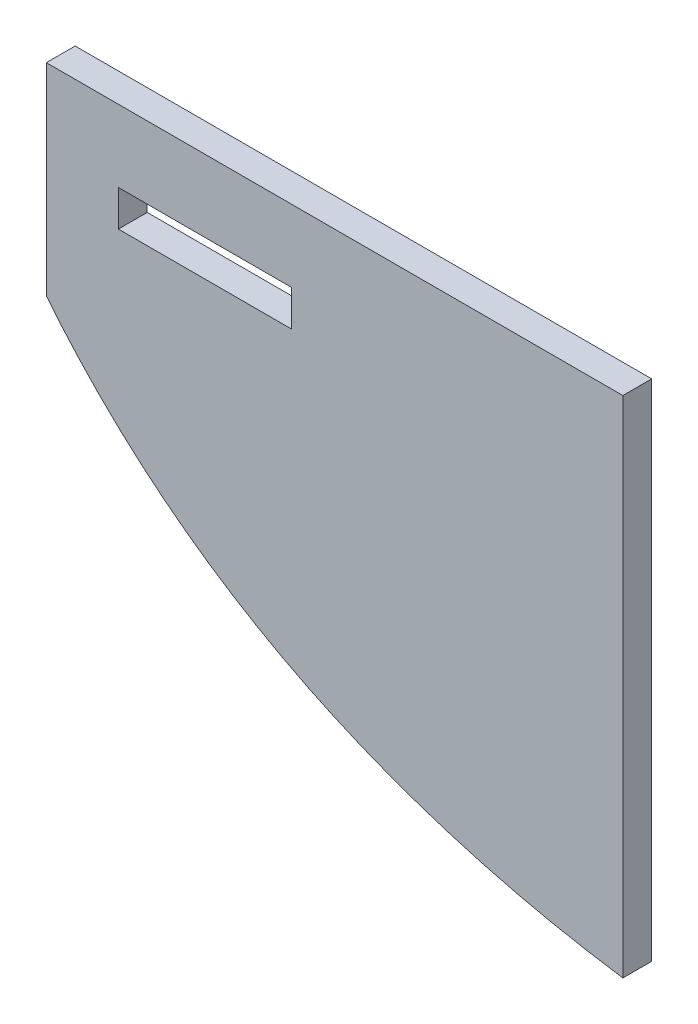
ISO-10303-21;
HEADER;
FILE_DESCRIPTION(('STEP AP214'),'2;1');
FILE_NAME('part.step','',(''),(''),'','','');
FILE_SCHEMA(('AUTOMOTIVE_DESIGN { 1 0 10303 214 1 1 1 1 }'));
ENDSEC;
DATA;
#1=APPLICATION_CONTEXT('core data for automotive mechanical design processes');
#2=APPLICATION_PROTOCOL_DEFINITION('international standard','automotive_design',2000,#1);
#3=PRODUCT_CONTEXT('',#1,'mechanical');
#4=PRODUCT('Part','Part','',(#3));
#5=PRODUCT_RELATED_PRODUCT_CATEGORY('part','',(#4));
#6=PRODUCT_DEFINITION_FORMATION('','',#4);
#7=PRODUCT_DEFINITION_CONTEXT('part definition',#1,'design');
#8=PRODUCT_DEFINITION('design','',#6,#7);
#9=PRODUCT_DEFINITION_SHAPE('','',#8);
#10=(LENGTH_UNIT() NAMED_UNIT(*) SI_UNIT(.MILLI.,.METRE.));
#11=(NAMED_UNIT(*) PLANE_ANGLE_UNIT() SI_UNIT($,.RADIAN.));
#12=(NAMED_UNIT(*) SI_UNIT($,.STERADIAN.) SOLID_ANGLE_UNIT());
#13=UNCERTAINTY_MEASURE_WITH_UNIT(LENGTH_MEASURE(1.E-05),#10,'distance_accuracy_value','');
#14=(GEOMETRIC_REPRESENTATION_CONTEXT(3) GLOBAL_UNCERTAINTY_ASSIGNED_CONTEXT((#13)) GLOBAL_UNIT_ASSIGNED_CONTEXT((#10,
#11,#12)) REPRESENTATION_CONTEXT('',''));
#15=CARTESIAN_POINT('',(0.,0.,0.));
#16=DIRECTION('',(0.,0.,1.));
#17=DIRECTION('',(1.,0.,0.));
#18=AXIS2_PLACEMENT_3D('',#15,#16,#17);
#19=CARTESIAN_POINT('',(0.,0.,2.));
#20=DIRECTION('',(0.,0.,-1.));
#21=DIRECTION('',(-1.,0.,0.));
#22=AXIS2_PLACEMENT_3D('',#19,#20,#21);
#23=PLANE('',#22);
#24=DIRECTION('',(0.,-1.,0.));
#25=VECTOR('',#24,1.);
#26=CARTESIAN_POINT('',(-20.,-17.5,2.));
#27=LINE('',#26,#25);
#28=CARTESIAN_POINT('',(-20.,17.5,2.));
#29=VERTEX_POINT('',#28);
#30=CARTESIAN_POINT('',(-20.0000000000738,3.48377974515954,2.));
#31=VERTEX_POINT('',#30);
#32=EDGE_CURVE('E110',#29,#31,#27,.T.);
#33=ORIENTED_EDGE('',*,*,#32,.T.);
#34=CARTESIAN_POINT('',(20.,-17.5,2.));
#35=CARTESIAN_POINT('',(-15.3606608467541,-12.269480231344,2.));
#36=CARTESIAN_POINT('',(-28.0306781575064,16.9364817728308,2.));
#37=B_SPLINE_CURVE_WITH_KNOTS('',2,(#34,#35,#36),.UNSPECIFIED.,.F.,.F.,(3,3),(0.,1.),.UNSPECIFIED.);
#38=CARTESIAN_POINT('',(20.,-17.5,2.));
#39=VERTEX_POINT('',#38);
#40=EDGE_CURVE('E102',#39,#31,#37,.T.);
#41=ORIENTED_EDGE('',*,*,#40,.F.);
#42=DIRECTION('',(0.,1.,0.));
#43=VECTOR('',#42,1.);
#44=CARTESIAN_POINT('',(20.,-17.5,2.));
#45=LINE('',#44,#43);
#46=CARTESIAN_POINT('',(20.,17.5,2.));
#47=VERTEX_POINT('',#46);
#48=EDGE_CURVE('E116',#39,#47,#45,.T.);
#49=ORIENTED_EDGE('',*,*,#48,.T.);
#50=DIRECTION('',(-1.,0.,0.));
#51=VECTOR('',#50,1.);
#52=CARTESIAN_POINT('',(-20.,17.5,2.));
#53=LINE('',#52,#51);
#54=EDGE_CURVE('E121',#47,#29,#53,.T.);
#55=ORIENTED_EDGE('',*,*,#54,.T.);
#56=EDGE_LOOP('',(#33,#41,#49,#55));
#57=FACE_BOUND('',#56,.T.);
#58=DIRECTION('',(0.,-1.,0.));
#59=VECTOR('',#58,1.);
#60=CARTESIAN_POINT('',(-15.,10.,2.));
#61=LINE('',#60,#59);
#62=CARTESIAN_POINT('',(-15.,12.5,2.));
#63=VERTEX_POINT('',#62);
#64=CARTESIAN_POINT('',(-15.,10.,2.));
#65=VERTEX_POINT('',#64);
#66=EDGE_CURVE('E151',#63,#65,#61,.T.);
#67=ORIENTED_EDGE('',*,*,#66,.F.);
#68=DIRECTION('',(-1.,0.,0.));
#69=VECTOR('',#68,1.);
#70=CARTESIAN_POINT('',(-15.,12.5,2.));
#71=LINE('',#70,#69);
#72=CARTESIAN_POINT('',(-3.,12.5,2.));
#73=VERTEX_POINT('',#72);
#74=EDGE_CURVE('E161',#73,#63,#71,.T.);
#75=ORIENTED_EDGE('',*,*,#74,.F.);
#76=DIRECTION('',(0.,1.,0.));
#77=VECTOR('',#76,1.);
#78=CARTESIAN_POINT('',(-3.,10.,2.));
#79=LINE('',#78,#77);
#80=CARTESIAN_POINT('',(-3.,10.,2.));
#81=VERTEX_POINT('',#80);
#82=EDGE_CURVE('E159',#81,#73,#79,.T.);
#83=ORIENTED_EDGE('',*,*,#82,.F.);
#84=DIRECTION('',(1.,0.,0.));
#85=VECTOR('',#84,1.);
#86=CARTESIAN_POINT('',(-15.,10.,2.));
#87=LINE('',#86,#85);
#88=EDGE_CURVE('E156',#65,#81,#87,.T.);
#89=ORIENTED_EDGE('',*,*,#88,.F.);
#90=EDGE_LOOP('',(#67,#75,#83,#89));
#91=FACE_BOUND('',#90,.T.);
#92=ADVANCED_FACE('F33',(#57,#91),#23,.F.);
#93=CARTESIAN_POINT('',(0.,0.,0.));
#94=DIRECTION('',(0.,0.,-1.));
#95=DIRECTION('',(-1.,0.,0.));
#96=AXIS2_PLACEMENT_3D('',#93,#94,#95);
#97=PLANE('',#96);
#98=CARTESIAN_POINT('',(20.,-17.5,0.));
#99=CARTESIAN_POINT('',(-15.3606608467541,-12.269480231344,0.));
#100=CARTESIAN_POINT('',(-28.0306781575064,16.9364817728308,0.));
#101=B_SPLINE_CURVE_WITH_KNOTS('',2,(#98,#99,#100),.UNSPECIFIED.,.F.,.F.,(3,3),(0.,1.),.UNSPECIFIED.);
#102=CARTESIAN_POINT('',(-20.,3.48377974506775,0.));
#103=VERTEX_POINT('',#102);
#104=CARTESIAN_POINT('',(20.,-17.5,0.));
#105=VERTEX_POINT('',#104);
#106=EDGE_CURVE('E105',#103,#105,#101,.F.);
#107=ORIENTED_EDGE('',*,*,#106,.F.);
#108=DIRECTION('',(0.,-1.,0.));
#109=VECTOR('',#108,1.);
#110=CARTESIAN_POINT('',(-20.,-17.5,0.));
#111=LINE('',#110,#109);
#112=CARTESIAN_POINT('',(-20.,17.5,0.));
#113=VERTEX_POINT('',#112);
#114=EDGE_CURVE('E122',#113,#103,#111,.T.);
#115=ORIENTED_EDGE('',*,*,#114,.F.);
#116=DIRECTION('',(-1.,0.,0.));
#117=VECTOR('',#116,1.);
#118=CARTESIAN_POINT('',(-20.,17.5,0.));
#119=LINE('',#118,#117);
#120=CARTESIAN_POINT('',(20.,17.5,0.));
#121=VERTEX_POINT('',#120);
#122=EDGE_CURVE('E126',#121,#113,#119,.T.);
#123=ORIENTED_EDGE('',*,*,#122,.F.);
#124=DIRECTION('',(0.,1.,0.));
#125=VECTOR('',#124,1.);
#126=CARTESIAN_POINT('',(20.,-17.5,0.));
#127=LINE('',#126,#125);
#128=EDGE_CURVE('E133',#105,#121,#127,.T.);
#129=ORIENTED_EDGE('',*,*,#128,.F.);
#130=EDGE_LOOP('',(#107,#115,#123,#129));
#131=FACE_BOUND('',#130,.T.);
#132=DIRECTION('',(-1.,0.,0.));
#133=VECTOR('',#132,1.);
#134=CARTESIAN_POINT('',(-15.,12.5,0.));
#135=LINE('',#134,#133);
#136=CARTESIAN_POINT('',(-3.,12.5,0.));
#137=VERTEX_POINT('',#136);
#138=CARTESIAN_POINT('',(-15.,12.5,0.));
#139=VERTEX_POINT('',#138);
#140=EDGE_CURVE('E157',#137,#139,#135,.T.);
#141=ORIENTED_EDGE('',*,*,#140,.T.);
#142=DIRECTION('',(0.,-1.,0.));
#143=VECTOR('',#142,1.);
#144=CARTESIAN_POINT('',(-15.,10.,0.));
#145=LINE('',#144,#143);
#146=CARTESIAN_POINT('',(-15.,10.,0.));
#147=VERTEX_POINT('',#146);
#148=EDGE_CURVE('E56',#139,#147,#145,.T.);
#149=ORIENTED_EDGE('',*,*,#148,.T.);
#150=DIRECTION('',(1.,0.,0.));
#151=VECTOR('',#150,1.);
#152=CARTESIAN_POINT('',(-15.,10.,0.));
#153=LINE('',#152,#151);
#154=CARTESIAN_POINT('',(-3.,10.,0.));
#155=VERTEX_POINT('',#154);
#156=EDGE_CURVE('E145',#147,#155,#153,.T.);
#157=ORIENTED_EDGE('',*,*,#156,.T.);
#158=DIRECTION('',(0.,1.,0.));
#159=VECTOR('',#158,1.);
#160=CARTESIAN_POINT('',(-3.,10.,0.));
#161=LINE('',#160,#159);
#162=EDGE_CURVE('E166',#155,#137,#161,.T.);
#163=ORIENTED_EDGE('',*,*,#162,.T.);
#164=EDGE_LOOP('',(#141,#149,#157,#163));
#165=FACE_BOUND('',#164,.T.);
#166=ADVANCED_FACE('F142',(#131,#165),#97,.T.);
#167=CARTESIAN_POINT('',(20.,-17.5,2.));
#168=DIRECTION('',(-1.,0.,0.));
#169=DIRECTION('',(0.,0.,1.));
#170=AXIS2_PLACEMENT_3D('',#167,#168,#169);
#171=PLANE('',#170);
#172=ORIENTED_EDGE('',*,*,#128,.T.);
#173=DIRECTION('',(0.,0.,-1.));
#174=VECTOR('',#173,1.);
#175=CARTESIAN_POINT('',(20.,17.5,2.));
#176=LINE('',#175,#174);
#177=EDGE_CURVE('E11',#47,#121,#176,.T.);
#178=ORIENTED_EDGE('',*,*,#177,.F.);
#179=ORIENTED_EDGE('',*,*,#48,.F.);
#180=DIRECTION('',(0.,0.,-1.));
#181=VECTOR('',#180,1.);
#182=CARTESIAN_POINT('',(20.,-17.5,2.));
#183=LINE('',#182,#181);
#184=EDGE_CURVE('E99',#39,#105,#183,.T.);
#185=ORIENTED_EDGE('',*,*,#184,.T.);
#186=EDGE_LOOP('',(#172,#178,#179,#185));
#187=FACE_BOUND('',#186,.T.);
#188=ADVANCED_FACE('F35',(#187),#171,.F.);
#189=CARTESIAN_POINT('',(-20.,17.5,2.));
#190=DIRECTION('',(0.,-1.,0.));
#191=DIRECTION('',(0.,0.,-1.));
#192=AXIS2_PLACEMENT_3D('',#189,#190,#191);
#193=PLANE('',#192);
#194=ORIENTED_EDGE('',*,*,#122,.T.);
#195=DIRECTION('',(0.,0.,-1.));
#196=VECTOR('',#195,1.);
#197=CARTESIAN_POINT('',(-20.,17.5,2.));
#198=LINE('',#197,#196);
#199=EDGE_CURVE('E41',#29,#113,#198,.T.);
#200=ORIENTED_EDGE('',*,*,#199,.F.);
#201=ORIENTED_EDGE('',*,*,#54,.F.);
#202=ORIENTED_EDGE('',*,*,#177,.T.);
#203=EDGE_LOOP('',(#194,#200,#201,#202));
#204=FACE_BOUND('',#203,.T.);
#205=ADVANCED_FACE('F203',(#204),#193,.F.);
#206=CARTESIAN_POINT('',(-20.,-17.5,2.));
#207=DIRECTION('',(1.,0.,0.));
#208=DIRECTION('',(0.,0.,-1.));
#209=AXIS2_PLACEMENT_3D('',#206,#207,#208);
#210=PLANE('',#209);
#211=ORIENTED_EDGE('',*,*,#114,.T.);
#212=DIRECTION('',(0.,0.,1.));
#213=VECTOR('',#212,1.);
#214=CARTESIAN_POINT('',(-20.,3.48377974506775,-8.));
#215=LINE('',#214,#213);
#216=EDGE_CURVE('E119',#103,#31,#215,.T.);
#217=ORIENTED_EDGE('',*,*,#216,.T.);
#218=ORIENTED_EDGE('',*,*,#32,.F.);
#219=ORIENTED_EDGE('',*,*,#199,.T.);
#220=EDGE_LOOP('',(#211,#217,#218,#219));
#221=FACE_BOUND('',#220,.T.);
#222=ADVANCED_FACE('F139',(#221),#210,.F.);
#223=CARTESIAN_POINT('',(-15.,10.,2.));
#224=DIRECTION('',(1.,0.,0.));
#225=DIRECTION('',(0.,0.,-1.));
#226=AXIS2_PLACEMENT_3D('',#223,#224,#225);
#227=PLANE('',#226);
#228=ORIENTED_EDGE('',*,*,#148,.F.);
#229=DIRECTION('',(0.,0.,-1.));
#230=VECTOR('',#229,1.);
#231=CARTESIAN_POINT('',(-15.,12.5,2.));
#232=LINE('',#231,#230);
#233=EDGE_CURVE('E162',#63,#139,#232,.T.);
#234=ORIENTED_EDGE('',*,*,#233,.F.);
#235=ORIENTED_EDGE('',*,*,#66,.T.);
#236=DIRECTION('',(0.,0.,-1.));
#237=VECTOR('',#236,1.);
#238=CARTESIAN_POINT('',(-15.,10.,2.));
#239=LINE('',#238,#237);
#240=EDGE_CURVE('E129',#65,#147,#239,.T.);
#241=ORIENTED_EDGE('',*,*,#240,.T.);
#242=EDGE_LOOP('',(#228,#234,#235,#241));
#243=FACE_BOUND('',#242,.T.);
#244=ADVANCED_FACE('F177',(#243),#227,.T.);
#245=CARTESIAN_POINT('',(-15.,10.,2.));
#246=DIRECTION('',(0.,1.,0.));
#247=DIRECTION('',(0.,0.,1.));
#248=AXIS2_PLACEMENT_3D('',#245,#246,#247);
#249=PLANE('',#248);
#250=ORIENTED_EDGE('',*,*,#156,.F.);
#251=ORIENTED_EDGE('',*,*,#240,.F.);
#252=ORIENTED_EDGE('',*,*,#88,.T.);
#253=DIRECTION('',(0.,0.,-1.));
#254=VECTOR('',#253,1.);
#255=CARTESIAN_POINT('',(-3.,10.,2.));
#256=LINE('',#255,#254);
#257=EDGE_CURVE('E172',#81,#155,#256,.T.);
#258=ORIENTED_EDGE('',*,*,#257,.T.);
#259=EDGE_LOOP('',(#250,#251,#252,#258));
#260=FACE_BOUND('',#259,.T.);
#261=ADVANCED_FACE('F183',(#260),#249,.T.);
#262=CARTESIAN_POINT('',(-3.,10.,2.));
#263=DIRECTION('',(-1.,0.,0.));
#264=DIRECTION('',(0.,0.,1.));
#265=AXIS2_PLACEMENT_3D('',#262,#263,#264);
#266=PLANE('',#265);
#267=ORIENTED_EDGE('',*,*,#162,.F.);
#268=ORIENTED_EDGE('',*,*,#257,.F.);
#269=ORIENTED_EDGE('',*,*,#82,.T.);
#270=DIRECTION('',(0.,0.,-1.));
#271=VECTOR('',#270,1.);
#272=CARTESIAN_POINT('',(-3.,12.5,2.));
#273=LINE('',#272,#271);
#274=EDGE_CURVE('E48',#73,#137,#273,.T.);
#275=ORIENTED_EDGE('',*,*,#274,.T.);
#276=EDGE_LOOP('',(#267,#268,#269,#275));
#277=FACE_BOUND('',#276,.T.);
#278=ADVANCED_FACE('F185',(#277),#266,.T.);
#279=CARTESIAN_POINT('',(-15.,12.5,2.));
#280=DIRECTION('',(0.,-1.,0.));
#281=DIRECTION('',(0.,0.,-1.));
#282=AXIS2_PLACEMENT_3D('',#279,#280,#281);
#283=PLANE('',#282);
#284=ORIENTED_EDGE('',*,*,#140,.F.);
#285=ORIENTED_EDGE('',*,*,#274,.F.);
#286=ORIENTED_EDGE('',*,*,#74,.T.);
#287=ORIENTED_EDGE('',*,*,#233,.T.);
#288=EDGE_LOOP('',(#284,#285,#286,#287));
#289=FACE_BOUND('',#288,.T.);
#290=ADVANCED_FACE('F180',(#289),#283,.T.);
#291=CARTESIAN_POINT('',(20.,-17.5,-8.));
#292=CARTESIAN_POINT('',(-15.3606608467541,-12.269480231344,-8.));
#293=CARTESIAN_POINT('',(-28.0306781575064,16.9364817728308,-8.));
#294=B_SPLINE_CURVE_WITH_KNOTS('',2,(#291,#292,#293),.UNSPECIFIED.,.F.,.F.,(3,3),(0.,1.),.UNSPECIFIED.);
#295=DIRECTION('',(0.,0.,1.));
#296=VECTOR('',#295,1.);
#297=SURFACE_OF_LINEAR_EXTRUSION('',#294,#296);
#298=ORIENTED_EDGE('',*,*,#106,.T.);
#299=ORIENTED_EDGE('',*,*,#184,.F.);
#300=ORIENTED_EDGE('',*,*,#40,.T.);
#301=ORIENTED_EDGE('',*,*,#216,.F.);
#302=EDGE_LOOP('',(#298,#299,#300,#301));
#303=FACE_BOUND('',#302,.T.);
#304=ADVANCED_FACE('F101',(#303),#297,.F.);
#305=CLOSED_SHELL('',(#92,#166,#188,#205,#222,#244,#261,#278,#290,#304));
#306=MANIFOLD_SOLID_BREP('B2',#305);
#307=ADVANCED_BREP_SHAPE_REPRESENTATION('',(#18,#306),#14);
#308=SHAPE_DEFINITION_REPRESENTATION(#9,#307);
ENDSEC;
END-ISO-10303-21;
